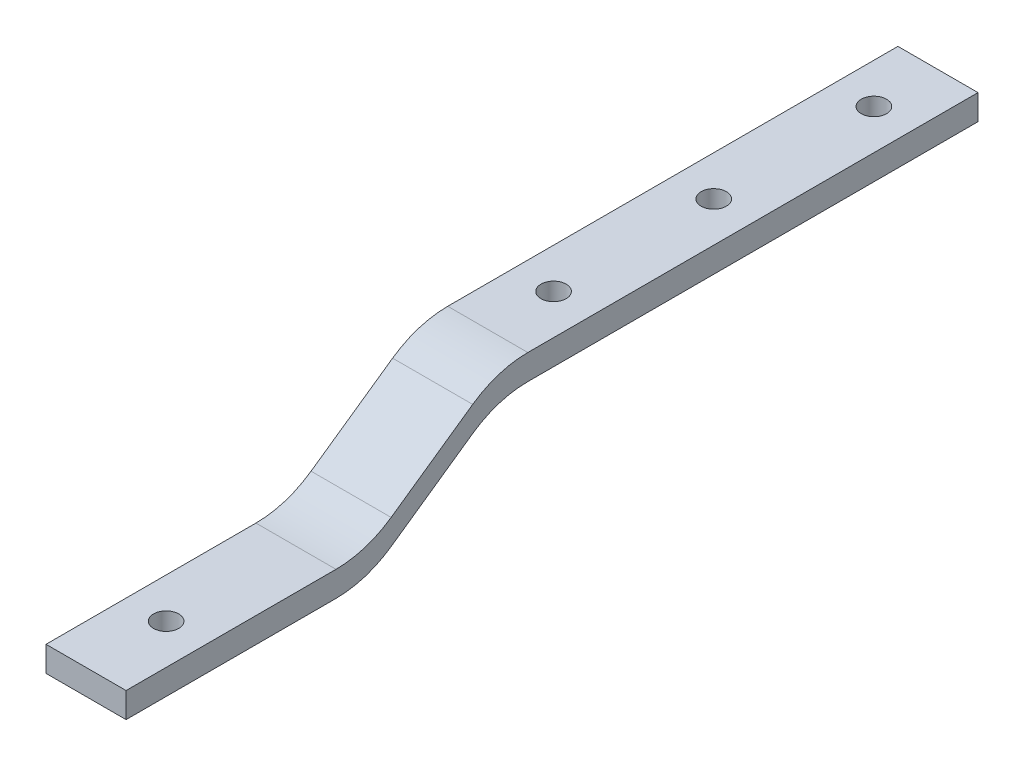
ISO-10303-21;
HEADER;
FILE_DESCRIPTION(('STEP AP214'),'2;1');
FILE_NAME('part.step','',(''),(''),'','','');
FILE_SCHEMA(('AUTOMOTIVE_DESIGN { 1 0 10303 214 1 1 1 1 }'));
ENDSEC;
DATA;
#1=APPLICATION_CONTEXT('core data for automotive mechanical design processes');
#2=APPLICATION_PROTOCOL_DEFINITION('international standard','automotive_design',2000,#1);
#3=PRODUCT_CONTEXT('',#1,'mechanical');
#4=PRODUCT('Part','Part','',(#3));
#5=PRODUCT_RELATED_PRODUCT_CATEGORY('part','',(#4));
#6=PRODUCT_DEFINITION_FORMATION('','',#4);
#7=PRODUCT_DEFINITION_CONTEXT('part definition',#1,'design');
#8=PRODUCT_DEFINITION('design','',#6,#7);
#9=PRODUCT_DEFINITION_SHAPE('','',#8);
#10=(LENGTH_UNIT() NAMED_UNIT(*) SI_UNIT(.MILLI.,.METRE.));
#11=(NAMED_UNIT(*) PLANE_ANGLE_UNIT() SI_UNIT($,.RADIAN.));
#12=(NAMED_UNIT(*) SI_UNIT($,.STERADIAN.) SOLID_ANGLE_UNIT());
#13=UNCERTAINTY_MEASURE_WITH_UNIT(LENGTH_MEASURE(1.E-05),#10,'distance_accuracy_value','');
#14=(GEOMETRIC_REPRESENTATION_CONTEXT(3) GLOBAL_UNCERTAINTY_ASSIGNED_CONTEXT((#13)) GLOBAL_UNIT_ASSIGNED_CONTEXT((#10,
#11,#12)) REPRESENTATION_CONTEXT('',''));
#15=CARTESIAN_POINT('',(0.,0.,0.));
#16=DIRECTION('',(0.,0.,1.));
#17=DIRECTION('',(1.,0.,0.));
#18=AXIS2_PLACEMENT_3D('',#15,#16,#17);
#19=CARTESIAN_POINT('',(6.35,0.,0.));
#20=DIRECTION('',(0.,0.,-1.));
#21=DIRECTION('',(-1.,0.,0.));
#22=AXIS2_PLACEMENT_3D('',#19,#20,#21);
#23=PLANE('',#22);
#24=DIRECTION('',(0.,-1.,0.));
#25=VECTOR('',#24,1.);
#26=CARTESIAN_POINT('',(0.,0.,0.));
#27=LINE('',#26,#25);
#28=CARTESIAN_POINT('',(0.,2.,0.));
#29=VERTEX_POINT('',#28);
#30=CARTESIAN_POINT('',(0.,0.,0.));
#31=VERTEX_POINT('',#30);
#32=EDGE_CURVE('E148',#29,#31,#27,.T.);
#33=ORIENTED_EDGE('',*,*,#32,.T.);
#34=DIRECTION('',(-1.,0.,0.));
#35=VECTOR('',#34,1.);
#36=CARTESIAN_POINT('',(6.35,0.,0.));
#37=LINE('',#36,#35);
#38=CARTESIAN_POINT('',(6.35,0.,0.));
#39=VERTEX_POINT('',#38);
#40=EDGE_CURVE('E131',#39,#31,#37,.T.);
#41=ORIENTED_EDGE('',*,*,#40,.F.);
#42=DIRECTION('',(0.,-1.,0.));
#43=VECTOR('',#42,1.);
#44=CARTESIAN_POINT('',(6.35,0.,0.));
#45=LINE('',#44,#43);
#46=CARTESIAN_POINT('',(6.35,2.,0.));
#47=VERTEX_POINT('',#46);
#48=EDGE_CURVE('E137',#47,#39,#45,.T.);
#49=ORIENTED_EDGE('',*,*,#48,.F.);
#50=DIRECTION('',(-1.,0.,0.));
#51=VECTOR('',#50,1.);
#52=CARTESIAN_POINT('',(6.35,2.,0.));
#53=LINE('',#52,#51);
#54=EDGE_CURVE('E200',#47,#29,#53,.T.);
#55=ORIENTED_EDGE('',*,*,#54,.T.);
#56=EDGE_LOOP('',(#33,#41,#49,#55));
#57=FACE_BOUND('',#56,.T.);
#58=ADVANCED_FACE('F37',(#57),#23,.F.);
#59=CARTESIAN_POINT('',(6.35,0.,-19.05));
#60=DIRECTION('',(0.,1.,0.));
#61=DIRECTION('',(0.,0.,1.));
#62=AXIS2_PLACEMENT_3D('',#59,#60,#61);
#63=PLANE('',#62);
#64=CARTESIAN_POINT('',(3.175,0.,-6.35));
#65=DIRECTION('',(0.,1.,0.));
#66=DIRECTION('',(0.,0.,1.));
#67=AXIS2_PLACEMENT_3D('',#64,#65,#66);
#68=CIRCLE('',#67,1.);
#69=CARTESIAN_POINT('',(3.175,0.,-5.35));
#70=VERTEX_POINT('',#69);
#71=EDGE_CURVE('E210',#70,#70,#68,.F.);
#72=ORIENTED_EDGE('',*,*,#71,.F.);
#73=EDGE_LOOP('',(#72));
#74=FACE_BOUND('',#73,.T.);
#75=DIRECTION('',(0.,0.,-1.));
#76=VECTOR('',#75,1.);
#77=CARTESIAN_POINT('',(0.,0.,-19.05));
#78=LINE('',#77,#76);
#79=CARTESIAN_POINT('',(0.,0.,-16.6474232287421));
#80=VERTEX_POINT('',#79);
#81=EDGE_CURVE('E209',#31,#80,#78,.T.);
#82=ORIENTED_EDGE('',*,*,#81,.T.);
#83=DIRECTION('',(-1.,0.,0.));
#84=VECTOR('',#83,1.);
#85=CARTESIAN_POINT('',(6.35,0.,-16.6474232287421));
#86=LINE('',#85,#84);
#87=CARTESIAN_POINT('',(6.35,0.,-16.6474232287421));
#88=VERTEX_POINT('',#87);
#89=EDGE_CURVE('E134',#80,#88,#86,.F.);
#90=ORIENTED_EDGE('',*,*,#89,.T.);
#91=DIRECTION('',(0.,0.,-1.));
#92=VECTOR('',#91,1.);
#93=CARTESIAN_POINT('',(6.35,0.,-19.05));
#94=LINE('',#93,#92);
#95=EDGE_CURVE('E126',#39,#88,#94,.T.);
#96=ORIENTED_EDGE('',*,*,#95,.F.);
#97=ORIENTED_EDGE('',*,*,#40,.T.);
#98=EDGE_LOOP('',(#82,#90,#96,#97));
#99=FACE_BOUND('',#98,.T.);
#100=ADVANCED_FACE('F129',(#74,#99),#63,.F.);
#101=CARTESIAN_POINT('',(6.35,7.2844207416583,-29.4532309624702));
#102=DIRECTION('',(0.,0.819152044288991,0.573576436351047));
#103=DIRECTION('',(0.,-0.573576436351047,0.819152044288991));
#104=AXIS2_PLACEMENT_3D('',#101,#102,#103);
#105=PLANE('',#104);
#106=DIRECTION('',(0.,0.573576436351047,-0.819152044288991));
#107=VECTOR('',#106,1.);
#108=CARTESIAN_POINT('',(6.35,7.2844207416583,-29.4532309624702));
#109=LINE('',#108,#107);
#110=CARTESIAN_POINT('',(6.35,1.37806142251789,-21.0180756737371));
#111=VERTEX_POINT('',#110);
#112=CARTESIAN_POINT('',(6.35,5.90635931914041,-27.4851552887331));
#113=VERTEX_POINT('',#112);
#114=EDGE_CURVE('E136',#111,#113,#109,.T.);
#115=ORIENTED_EDGE('',*,*,#114,.F.);
#116=DIRECTION('',(-1.,0.,0.));
#117=VECTOR('',#116,1.);
#118=CARTESIAN_POINT('',(6.35,1.37806142251789,-21.0180756737371));
#119=LINE('',#118,#117);
#120=CARTESIAN_POINT('',(0.,1.37806142251789,-21.0180756737371));
#121=VERTEX_POINT('',#120);
#122=EDGE_CURVE('E152',#111,#121,#119,.T.);
#123=ORIENTED_EDGE('',*,*,#122,.T.);
#124=DIRECTION('',(0.,0.573576436351047,-0.819152044288991));
#125=VECTOR('',#124,1.);
#126=CARTESIAN_POINT('',(0.,7.2844207416583,-29.4532309624702));
#127=LINE('',#126,#125);
#128=CARTESIAN_POINT('',(0.,5.90635931914041,-27.4851552887331));
#129=VERTEX_POINT('',#128);
#130=EDGE_CURVE('E212',#121,#129,#127,.T.);
#131=ORIENTED_EDGE('',*,*,#130,.T.);
#132=DIRECTION('',(-1.,0.,0.));
#133=VECTOR('',#132,1.);
#134=CARTESIAN_POINT('',(6.35,5.90635931914041,-27.4851552887331));
#135=LINE('',#134,#133);
#136=EDGE_CURVE('E149',#129,#113,#135,.F.);
#137=ORIENTED_EDGE('',*,*,#136,.T.);
#138=EDGE_LOOP('',(#115,#123,#131,#137));
#139=FACE_BOUND('',#138,.T.);
#140=ADVANCED_FACE('F273',(#139),#105,.F.);
#141=CARTESIAN_POINT('',(6.35,7.2844207416583,-67.5532309624702));
#142=DIRECTION('',(0.,1.,0.));
#143=DIRECTION('',(0.,0.,1.));
#144=AXIS2_PLACEMENT_3D('',#141,#142,#143);
#145=PLANE('',#144);
#146=CARTESIAN_POINT('',(3.175,7.2844207416583,-37.0732309624702));
#147=DIRECTION('',(0.,1.,0.));
#148=DIRECTION('',(0.,0.,1.));
#149=AXIS2_PLACEMENT_3D('',#146,#147,#148);
#150=CIRCLE('',#149,1.);
#151=CARTESIAN_POINT('',(3.175,7.2844207416583,-36.0732309624702));
#152=VERTEX_POINT('',#151);
#153=EDGE_CURVE('E262',#152,#152,#150,.F.);
#154=ORIENTED_EDGE('',*,*,#153,.F.);
#155=EDGE_LOOP('',(#154));
#156=FACE_BOUND('',#155,.T.);
#157=CARTESIAN_POINT('',(3.175,7.2844207416583,-49.7732309624702));
#158=DIRECTION('',(0.,1.,0.));
#159=DIRECTION('',(0.,0.,1.));
#160=AXIS2_PLACEMENT_3D('',#157,#158,#159);
#161=CIRCLE('',#160,1.);
#162=CARTESIAN_POINT('',(3.175,7.2844207416583,-48.7732309624702));
#163=VERTEX_POINT('',#162);
#164=EDGE_CURVE('E256',#163,#163,#161,.F.);
#165=ORIENTED_EDGE('',*,*,#164,.F.);
#166=EDGE_LOOP('',(#165));
#167=FACE_BOUND('',#166,.T.);
#168=CARTESIAN_POINT('',(3.175,7.2844207416583,-62.4732309624702));
#169=DIRECTION('',(0.,1.,0.));
#170=DIRECTION('',(0.,0.,1.));
#171=AXIS2_PLACEMENT_3D('',#168,#169,#170);
#172=CIRCLE('',#171,1.);
#173=CARTESIAN_POINT('',(3.175,7.2844207416583,-61.4732309624702));
#174=VERTEX_POINT('',#173);
#175=EDGE_CURVE('E247',#174,#174,#172,.F.);
#176=ORIENTED_EDGE('',*,*,#175,.F.);
#177=EDGE_LOOP('',(#176));
#178=FACE_BOUND('',#177,.T.);
#179=DIRECTION('',(0.,0.,-1.));
#180=VECTOR('',#179,1.);
#181=CARTESIAN_POINT('',(6.35,7.2844207416583,-67.5532309624702));
#182=LINE('',#181,#180);
#183=CARTESIAN_POINT('',(6.35,7.2844207416583,-31.855807733728));
#184=VERTEX_POINT('',#183);
#185=CARTESIAN_POINT('',(6.35,7.2844207416583,-67.5532309624702));
#186=VERTEX_POINT('',#185);
#187=EDGE_CURVE('E236',#184,#186,#182,.T.);
#188=ORIENTED_EDGE('',*,*,#187,.F.);
#189=DIRECTION('',(-1.,0.,0.));
#190=VECTOR('',#189,1.);
#191=CARTESIAN_POINT('',(0.,7.2844207416583,-31.855807733728));
#192=LINE('',#191,#190);
#193=CARTESIAN_POINT('',(0.,7.2844207416583,-31.855807733728));
#194=VERTEX_POINT('',#193);
#195=EDGE_CURVE('E170',#184,#194,#192,.T.);
#196=ORIENTED_EDGE('',*,*,#195,.T.);
#197=DIRECTION('',(0.,0.,-1.));
#198=VECTOR('',#197,1.);
#199=CARTESIAN_POINT('',(0.,7.2844207416583,-67.5532309624702));
#200=LINE('',#199,#198);
#201=CARTESIAN_POINT('',(0.,7.2844207416583,-67.5532309624702));
#202=VERTEX_POINT('',#201);
#203=EDGE_CURVE('E215',#194,#202,#200,.T.);
#204=ORIENTED_EDGE('',*,*,#203,.T.);
#205=DIRECTION('',(-1.,0.,0.));
#206=VECTOR('',#205,1.);
#207=CARTESIAN_POINT('',(6.35,7.2844207416583,-67.5532309624702));
#208=LINE('',#207,#206);
#209=EDGE_CURVE('E150',#186,#202,#208,.T.);
#210=ORIENTED_EDGE('',*,*,#209,.F.);
#211=EDGE_LOOP('',(#188,#196,#204,#210));
#212=FACE_BOUND('',#211,.T.);
#213=ADVANCED_FACE('F269',(#156,#167,#178,#212),#145,.F.);
#214=CARTESIAN_POINT('',(6.35,7.2844207416583,-67.5532309624702));
#215=DIRECTION('',(0.,0.,1.));
#216=DIRECTION('',(1.,0.,0.));
#217=AXIS2_PLACEMENT_3D('',#214,#215,#216);
#218=PLANE('',#217);
#219=DIRECTION('',(0.,1.,0.));
#220=VECTOR('',#219,1.);
#221=CARTESIAN_POINT('',(0.,7.2844207416583,-67.5532309624702));
#222=LINE('',#221,#220);
#223=CARTESIAN_POINT('',(0.,9.2844207416583,-67.5532309624702));
#224=VERTEX_POINT('',#223);
#225=EDGE_CURVE('E217',#202,#224,#222,.T.);
#226=ORIENTED_EDGE('',*,*,#225,.T.);
#227=DIRECTION('',(-1.,0.,0.));
#228=VECTOR('',#227,1.);
#229=CARTESIAN_POINT('',(6.35,9.2844207416583,-67.5532309624702));
#230=LINE('',#229,#228);
#231=CARTESIAN_POINT('',(6.35,9.2844207416583,-67.5532309624702));
#232=VERTEX_POINT('',#231);
#233=EDGE_CURVE('E155',#232,#224,#230,.T.);
#234=ORIENTED_EDGE('',*,*,#233,.F.);
#235=DIRECTION('',(0.,1.,0.));
#236=VECTOR('',#235,1.);
#237=CARTESIAN_POINT('',(6.35,7.2844207416583,-67.5532309624702));
#238=LINE('',#237,#236);
#239=EDGE_CURVE('E235',#186,#232,#238,.T.);
#240=ORIENTED_EDGE('',*,*,#239,.F.);
#241=ORIENTED_EDGE('',*,*,#209,.T.);
#242=EDGE_LOOP('',(#226,#234,#240,#241));
#243=FACE_BOUND('',#242,.T.);
#244=ADVANCED_FACE('F272',(#243),#218,.F.);
#245=CARTESIAN_POINT('',(6.35,9.2844207416583,-67.5532309624702));
#246=DIRECTION('',(0.,-1.,0.));
#247=DIRECTION('',(0.,0.,-1.));
#248=AXIS2_PLACEMENT_3D('',#245,#246,#247);
#249=PLANE('',#248);
#250=CARTESIAN_POINT('',(3.175,9.28442074165829,-37.0732309624702));
#251=DIRECTION('',(0.,1.,0.));
#252=DIRECTION('',(0.,0.,1.));
#253=AXIS2_PLACEMENT_3D('',#250,#251,#252);
#254=CIRCLE('',#253,1.);
#255=CARTESIAN_POINT('',(3.175,9.28442074165829,-36.0732309624702));
#256=VERTEX_POINT('',#255);
#257=EDGE_CURVE('E259',#256,#256,#254,.T.);
#258=ORIENTED_EDGE('',*,*,#257,.F.);
#259=EDGE_LOOP('',(#258));
#260=FACE_BOUND('',#259,.T.);
#261=CARTESIAN_POINT('',(3.175,9.2844207416583,-49.7732309624702));
#262=DIRECTION('',(0.,1.,0.));
#263=DIRECTION('',(0.,0.,1.));
#264=AXIS2_PLACEMENT_3D('',#261,#262,#263);
#265=CIRCLE('',#264,1.);
#266=CARTESIAN_POINT('',(3.175,9.2844207416583,-48.7732309624702));
#267=VERTEX_POINT('',#266);
#268=EDGE_CURVE('E253',#267,#267,#265,.T.);
#269=ORIENTED_EDGE('',*,*,#268,.F.);
#270=EDGE_LOOP('',(#269));
#271=FACE_BOUND('',#270,.T.);
#272=CARTESIAN_POINT('',(3.175,9.2844207416583,-62.4732309624702));
#273=DIRECTION('',(0.,1.,0.));
#274=DIRECTION('',(0.,0.,1.));
#275=AXIS2_PLACEMENT_3D('',#272,#273,#274);
#276=CIRCLE('',#275,1.);
#277=CARTESIAN_POINT('',(3.175,9.2844207416583,-61.4732309624702));
#278=VERTEX_POINT('',#277);
#279=EDGE_CURVE('E250',#278,#278,#276,.T.);
#280=ORIENTED_EDGE('',*,*,#279,.F.);
#281=EDGE_LOOP('',(#280));
#282=FACE_BOUND('',#281,.T.);
#283=DIRECTION('',(0.,0.,1.));
#284=VECTOR('',#283,1.);
#285=CARTESIAN_POINT('',(0.,9.2844207416583,-67.5532309624702));
#286=LINE('',#285,#284);
#287=CARTESIAN_POINT('',(0.,9.2844207416583,-31.855807733728));
#288=VERTEX_POINT('',#287);
#289=EDGE_CURVE('E195',#224,#288,#286,.T.);
#290=ORIENTED_EDGE('',*,*,#289,.T.);
#291=DIRECTION('',(-1.,0.,0.));
#292=VECTOR('',#291,1.);
#293=CARTESIAN_POINT('',(6.35,9.2844207416583,-31.855807733728));
#294=LINE('',#293,#292);
#295=CARTESIAN_POINT('',(6.35,9.2844207416583,-31.855807733728));
#296=VERTEX_POINT('',#295);
#297=EDGE_CURVE('E180',#288,#296,#294,.F.);
#298=ORIENTED_EDGE('',*,*,#297,.T.);
#299=DIRECTION('',(0.,0.,1.));
#300=VECTOR('',#299,1.);
#301=CARTESIAN_POINT('',(6.35,9.2844207416583,-67.5532309624702));
#302=LINE('',#301,#300);
#303=EDGE_CURVE('E204',#232,#296,#302,.T.);
#304=ORIENTED_EDGE('',*,*,#303,.F.);
#305=ORIENTED_EDGE('',*,*,#233,.T.);
#306=EDGE_LOOP('',(#290,#298,#304,#305));
#307=FACE_BOUND('',#306,.T.);
#308=ADVANCED_FACE('F226',(#260,#271,#282,#307),#249,.F.);
#309=CARTESIAN_POINT('',(6.35,2.,-19.05));
#310=DIRECTION('',(0.,-0.819152044288991,-0.573576436351047));
#311=DIRECTION('',(0.,0.573576436351047,-0.819152044288991));
#312=AXIS2_PLACEMENT_3D('',#309,#310,#311);
#313=PLANE('',#312);
#314=DIRECTION('',(0.,-0.573576436351047,0.819152044288991));
#315=VECTOR('',#314,1.);
#316=CARTESIAN_POINT('',(0.,2.,-19.05));
#317=LINE('',#316,#315);
#318=CARTESIAN_POINT('',(0.,7.90635931914041,-27.4851552887331));
#319=VERTEX_POINT('',#318);
#320=CARTESIAN_POINT('',(0.,3.37806142251789,-21.0180756737371));
#321=VERTEX_POINT('',#320);
#322=EDGE_CURVE('E190',#319,#321,#317,.T.);
#323=ORIENTED_EDGE('',*,*,#322,.T.);
#324=DIRECTION('',(-1.,0.,0.));
#325=VECTOR('',#324,1.);
#326=CARTESIAN_POINT('',(6.35,3.37806142251789,-21.0180756737371));
#327=LINE('',#326,#325);
#328=CARTESIAN_POINT('',(6.35,3.37806142251789,-21.0180756737371));
#329=VERTEX_POINT('',#328);
#330=EDGE_CURVE('E58',#321,#329,#327,.F.);
#331=ORIENTED_EDGE('',*,*,#330,.T.);
#332=DIRECTION('',(0.,-0.573576436351047,0.819152044288991));
#333=VECTOR('',#332,1.);
#334=CARTESIAN_POINT('',(6.35,2.,-19.05));
#335=LINE('',#334,#333);
#336=CARTESIAN_POINT('',(6.35,7.90635931914041,-27.4851552887331));
#337=VERTEX_POINT('',#336);
#338=EDGE_CURVE('E201',#337,#329,#335,.T.);
#339=ORIENTED_EDGE('',*,*,#338,.F.);
#340=DIRECTION('',(-1.,0.,0.));
#341=VECTOR('',#340,1.);
#342=CARTESIAN_POINT('',(6.35,7.90635931914041,-27.4851552887331));
#343=LINE('',#342,#341);
#344=EDGE_CURVE('E176',#337,#319,#343,.T.);
#345=ORIENTED_EDGE('',*,*,#344,.T.);
#346=EDGE_LOOP('',(#323,#331,#339,#345));
#347=FACE_BOUND('',#346,.T.);
#348=ADVANCED_FACE('F193',(#347),#313,.F.);
#349=CARTESIAN_POINT('',(6.35,2.,0.));
#350=DIRECTION('',(0.,-1.,0.));
#351=DIRECTION('',(0.,0.,-1.));
#352=AXIS2_PLACEMENT_3D('',#349,#350,#351);
#353=PLANE('',#352);
#354=CARTESIAN_POINT('',(3.175,2.,-6.35));
#355=DIRECTION('',(0.,1.,0.));
#356=DIRECTION('',(0.,0.,1.));
#357=AXIS2_PLACEMENT_3D('',#354,#355,#356);
#358=CIRCLE('',#357,1.);
#359=CARTESIAN_POINT('',(3.175,2.,-5.35));
#360=VERTEX_POINT('',#359);
#361=EDGE_CURVE('E244',#360,#360,#358,.T.);
#362=ORIENTED_EDGE('',*,*,#361,.F.);
#363=EDGE_LOOP('',(#362));
#364=FACE_BOUND('',#363,.T.);
#365=DIRECTION('',(0.,0.,1.));
#366=VECTOR('',#365,1.);
#367=CARTESIAN_POINT('',(6.35,2.,0.));
#368=LINE('',#367,#366);
#369=CARTESIAN_POINT('',(6.35,2.,-16.6474232287421));
#370=VERTEX_POINT('',#369);
#371=EDGE_CURVE('E141',#370,#47,#368,.T.);
#372=ORIENTED_EDGE('',*,*,#371,.F.);
#373=DIRECTION('',(-1.,0.,0.));
#374=VECTOR('',#373,1.);
#375=CARTESIAN_POINT('',(0.,2.,-16.6474232287421));
#376=LINE('',#375,#374);
#377=CARTESIAN_POINT('',(0.,2.,-16.6474232287421));
#378=VERTEX_POINT('',#377);
#379=EDGE_CURVE('E173',#370,#378,#376,.T.);
#380=ORIENTED_EDGE('',*,*,#379,.T.);
#381=DIRECTION('',(0.,0.,1.));
#382=VECTOR('',#381,1.);
#383=CARTESIAN_POINT('',(0.,2.,0.));
#384=LINE('',#383,#382);
#385=EDGE_CURVE('E145',#378,#29,#384,.T.);
#386=ORIENTED_EDGE('',*,*,#385,.T.);
#387=ORIENTED_EDGE('',*,*,#54,.F.);
#388=EDGE_LOOP('',(#372,#380,#386,#387));
#389=FACE_BOUND('',#388,.T.);
#390=ADVANCED_FACE('F199',(#364,#389),#353,.F.);
#391=CARTESIAN_POINT('',(6.35,0.,0.));
#392=DIRECTION('',(-1.,0.,0.));
#393=DIRECTION('',(0.,0.,1.));
#394=AXIS2_PLACEMENT_3D('',#391,#392,#393);
#395=PLANE('',#394);
#396=ORIENTED_EDGE('',*,*,#95,.T.);
#397=CARTESIAN_POINT('',(6.35,7.62,-16.6474232287421));
#398=DIRECTION('',(-1.,0.,0.));
#399=DIRECTION('',(0.,0.,1.));
#400=AXIS2_PLACEMENT_3D('',#397,#398,#399);
#401=CIRCLE('',#400,7.62);
#402=EDGE_CURVE('E168',#88,#111,#401,.F.);
#403=ORIENTED_EDGE('',*,*,#402,.T.);
#404=ORIENTED_EDGE('',*,*,#114,.T.);
#405=CARTESIAN_POINT('',(6.35,-0.335579258341703,-31.855807733728));
#406=DIRECTION('',(-1.,0.,0.));
#407=DIRECTION('',(0.,0.,1.));
#408=AXIS2_PLACEMENT_3D('',#405,#406,#407);
#409=CIRCLE('',#408,7.62);
#410=EDGE_CURVE('E184',#113,#184,#409,.T.);
#411=ORIENTED_EDGE('',*,*,#410,.T.);
#412=ORIENTED_EDGE('',*,*,#187,.T.);
#413=ORIENTED_EDGE('',*,*,#239,.T.);
#414=ORIENTED_EDGE('',*,*,#303,.T.);
#415=CARTESIAN_POINT('',(6.35,1.6644207416583,-31.855807733728));
#416=DIRECTION('',(-1.,0.,0.));
#417=DIRECTION('',(0.,0.,1.));
#418=AXIS2_PLACEMENT_3D('',#415,#416,#417);
#419=CIRCLE('',#418,7.62);
#420=EDGE_CURVE('E166',#296,#337,#419,.F.);
#421=ORIENTED_EDGE('',*,*,#420,.T.);
#422=ORIENTED_EDGE('',*,*,#338,.T.);
#423=CARTESIAN_POINT('',(6.35,9.62,-16.6474232287421));
#424=DIRECTION('',(-1.,0.,0.));
#425=DIRECTION('',(0.,0.,1.));
#426=AXIS2_PLACEMENT_3D('',#423,#424,#425);
#427=CIRCLE('',#426,7.62);
#428=EDGE_CURVE('E11',#329,#370,#427,.T.);
#429=ORIENTED_EDGE('',*,*,#428,.T.);
#430=ORIENTED_EDGE('',*,*,#371,.T.);
#431=ORIENTED_EDGE('',*,*,#48,.T.);
#432=EDGE_LOOP('',(#396,#403,#404,#411,#412,#413,#414,#421,#422,#429,#430,#431));
#433=FACE_BOUND('',#432,.T.);
#434=ADVANCED_FACE('F140',(#433),#395,.F.);
#435=CARTESIAN_POINT('',(0.,0.,0.));
#436=DIRECTION('',(-1.,0.,0.));
#437=DIRECTION('',(0.,0.,1.));
#438=AXIS2_PLACEMENT_3D('',#435,#436,#437);
#439=PLANE('',#438);
#440=ORIENTED_EDGE('',*,*,#130,.F.);
#441=CARTESIAN_POINT('',(0.,7.62,-16.6474232287421));
#442=DIRECTION('',(-1.,0.,0.));
#443=DIRECTION('',(0.,0.,1.));
#444=AXIS2_PLACEMENT_3D('',#441,#442,#443);
#445=CIRCLE('',#444,7.62);
#446=EDGE_CURVE('E163',#121,#80,#445,.T.);
#447=ORIENTED_EDGE('',*,*,#446,.T.);
#448=ORIENTED_EDGE('',*,*,#81,.F.);
#449=ORIENTED_EDGE('',*,*,#32,.F.);
#450=ORIENTED_EDGE('',*,*,#385,.F.);
#451=CARTESIAN_POINT('',(0.,9.62,-16.6474232287421));
#452=DIRECTION('',(-1.,0.,0.));
#453=DIRECTION('',(0.,0.,1.));
#454=AXIS2_PLACEMENT_3D('',#451,#452,#453);
#455=CIRCLE('',#454,7.62);
#456=EDGE_CURVE('E45',#378,#321,#455,.F.);
#457=ORIENTED_EDGE('',*,*,#456,.T.);
#458=ORIENTED_EDGE('',*,*,#322,.F.);
#459=CARTESIAN_POINT('',(0.,1.6644207416583,-31.855807733728));
#460=DIRECTION('',(-1.,0.,0.));
#461=DIRECTION('',(0.,0.,1.));
#462=AXIS2_PLACEMENT_3D('',#459,#460,#461);
#463=CIRCLE('',#462,7.62);
#464=EDGE_CURVE('E161',#319,#288,#463,.T.);
#465=ORIENTED_EDGE('',*,*,#464,.T.);
#466=ORIENTED_EDGE('',*,*,#289,.F.);
#467=ORIENTED_EDGE('',*,*,#225,.F.);
#468=ORIENTED_EDGE('',*,*,#203,.F.);
#469=CARTESIAN_POINT('',(0.,-0.335579258341703,-31.855807733728));
#470=DIRECTION('',(-1.,0.,0.));
#471=DIRECTION('',(0.,0.,1.));
#472=AXIS2_PLACEMENT_3D('',#469,#470,#471);
#473=CIRCLE('',#472,7.62);
#474=EDGE_CURVE('E182',#194,#129,#473,.F.);
#475=ORIENTED_EDGE('',*,*,#474,.T.);
#476=EDGE_LOOP('',(#440,#447,#448,#449,#450,#457,#458,#465,#466,#467,#468,#475));
#477=FACE_BOUND('',#476,.T.);
#478=ADVANCED_FACE('F189',(#477),#439,.T.);
#479=CARTESIAN_POINT('',(3.175,-2.82842712474619,-6.35));
#480=DIRECTION('',(0.,1.,0.));
#481=DIRECTION('',(0.,0.,1.));
#482=AXIS2_PLACEMENT_3D('',#479,#480,#481);
#483=CYLINDRICAL_SURFACE('',#482,1.);
#484=ORIENTED_EDGE('',*,*,#71,.T.);
#485=EDGE_LOOP('',(#484));
#486=FACE_BOUND('',#485,.T.);
#487=ORIENTED_EDGE('',*,*,#361,.T.);
#488=EDGE_LOOP('',(#487));
#489=FACE_BOUND('',#488,.T.);
#490=ADVANCED_FACE('F322',(#486,#489),#483,.F.);
#491=CARTESIAN_POINT('',(3.175,4.45599361691211,-62.4732309624702));
#492=DIRECTION('',(0.,1.,0.));
#493=DIRECTION('',(0.,0.,1.));
#494=AXIS2_PLACEMENT_3D('',#491,#492,#493);
#495=CYLINDRICAL_SURFACE('',#494,1.);
#496=ORIENTED_EDGE('',*,*,#175,.T.);
#497=EDGE_LOOP('',(#496));
#498=FACE_BOUND('',#497,.T.);
#499=ORIENTED_EDGE('',*,*,#279,.T.);
#500=EDGE_LOOP('',(#499));
#501=FACE_BOUND('',#500,.T.);
#502=ADVANCED_FACE('F327',(#498,#501),#495,.F.);
#503=CARTESIAN_POINT('',(3.175,4.45599361691211,-49.7732309624702));
#504=DIRECTION('',(0.,1.,0.));
#505=DIRECTION('',(0.,0.,1.));
#506=AXIS2_PLACEMENT_3D('',#503,#504,#505);
#507=CYLINDRICAL_SURFACE('',#506,1.);
#508=ORIENTED_EDGE('',*,*,#164,.T.);
#509=EDGE_LOOP('',(#508));
#510=FACE_BOUND('',#509,.T.);
#511=ORIENTED_EDGE('',*,*,#268,.T.);
#512=EDGE_LOOP('',(#511));
#513=FACE_BOUND('',#512,.T.);
#514=ADVANCED_FACE('F298',(#510,#513),#507,.F.);
#515=CARTESIAN_POINT('',(3.175,4.45599361691211,-37.0732309624702));
#516=DIRECTION('',(0.,1.,0.));
#517=DIRECTION('',(0.,0.,1.));
#518=AXIS2_PLACEMENT_3D('',#515,#516,#517);
#519=CYLINDRICAL_SURFACE('',#518,1.);
#520=ORIENTED_EDGE('',*,*,#153,.T.);
#521=EDGE_LOOP('',(#520));
#522=FACE_BOUND('',#521,.T.);
#523=ORIENTED_EDGE('',*,*,#257,.T.);
#524=EDGE_LOOP('',(#523));
#525=FACE_BOUND('',#524,.T.);
#526=ADVANCED_FACE('F266',(#522,#525),#519,.F.);
#527=CARTESIAN_POINT('',(6.35,7.62,-16.6474232287421));
#528=DIRECTION('',(-1.,0.,0.));
#529=DIRECTION('',(0.,0.,1.));
#530=AXIS2_PLACEMENT_3D('',#527,#528,#529);
#531=CYLINDRICAL_SURFACE('',#530,7.62);
#532=ORIENTED_EDGE('',*,*,#402,.F.);
#533=ORIENTED_EDGE('',*,*,#89,.F.);
#534=ORIENTED_EDGE('',*,*,#446,.F.);
#535=ORIENTED_EDGE('',*,*,#122,.F.);
#536=EDGE_LOOP('',(#532,#533,#534,#535));
#537=FACE_BOUND('',#536,.T.);
#538=ADVANCED_FACE('F290',(#537),#531,.T.);
#539=CARTESIAN_POINT('',(6.35,-0.335579258341703,-31.855807733728));
#540=DIRECTION('',(1.,0.,0.));
#541=DIRECTION('',(0.,0.,-1.));
#542=AXIS2_PLACEMENT_3D('',#539,#540,#541);
#543=CYLINDRICAL_SURFACE('',#542,7.62);
#544=ORIENTED_EDGE('',*,*,#410,.F.);
#545=ORIENTED_EDGE('',*,*,#136,.F.);
#546=ORIENTED_EDGE('',*,*,#474,.F.);
#547=ORIENTED_EDGE('',*,*,#195,.F.);
#548=EDGE_LOOP('',(#544,#545,#546,#547));
#549=FACE_BOUND('',#548,.T.);
#550=ADVANCED_FACE('F284',(#549),#543,.F.);
#551=CARTESIAN_POINT('',(6.35,9.62,-16.6474232287421));
#552=DIRECTION('',(1.,0.,0.));
#553=DIRECTION('',(0.,0.,-1.));
#554=AXIS2_PLACEMENT_3D('',#551,#552,#553);
#555=CYLINDRICAL_SURFACE('',#554,7.62);
#556=ORIENTED_EDGE('',*,*,#428,.F.);
#557=ORIENTED_EDGE('',*,*,#330,.F.);
#558=ORIENTED_EDGE('',*,*,#456,.F.);
#559=ORIENTED_EDGE('',*,*,#379,.F.);
#560=EDGE_LOOP('',(#556,#557,#558,#559));
#561=FACE_BOUND('',#560,.T.);
#562=ADVANCED_FACE('F197',(#561),#555,.F.);
#563=CARTESIAN_POINT('',(6.35,1.6644207416583,-31.855807733728));
#564=DIRECTION('',(-1.,0.,0.));
#565=DIRECTION('',(0.,0.,1.));
#566=AXIS2_PLACEMENT_3D('',#563,#564,#565);
#567=CYLINDRICAL_SURFACE('',#566,7.62);
#568=ORIENTED_EDGE('',*,*,#420,.F.);
#569=ORIENTED_EDGE('',*,*,#297,.F.);
#570=ORIENTED_EDGE('',*,*,#464,.F.);
#571=ORIENTED_EDGE('',*,*,#344,.F.);
#572=EDGE_LOOP('',(#568,#569,#570,#571));
#573=FACE_BOUND('',#572,.T.);
#574=ADVANCED_FACE('F39',(#573),#567,.T.);
#575=CLOSED_SHELL('',(#58,#100,#140,#213,#244,#308,#348,#390,#434,#478,#490,#502,#514,#526,#538,
#550,#562,#574));
#576=MANIFOLD_SOLID_BREP('B2',#575);
#577=ADVANCED_BREP_SHAPE_REPRESENTATION('',(#18,#576),#14);
#578=SHAPE_DEFINITION_REPRESENTATION(#9,#577);
ENDSEC;
END-ISO-10303-21;
